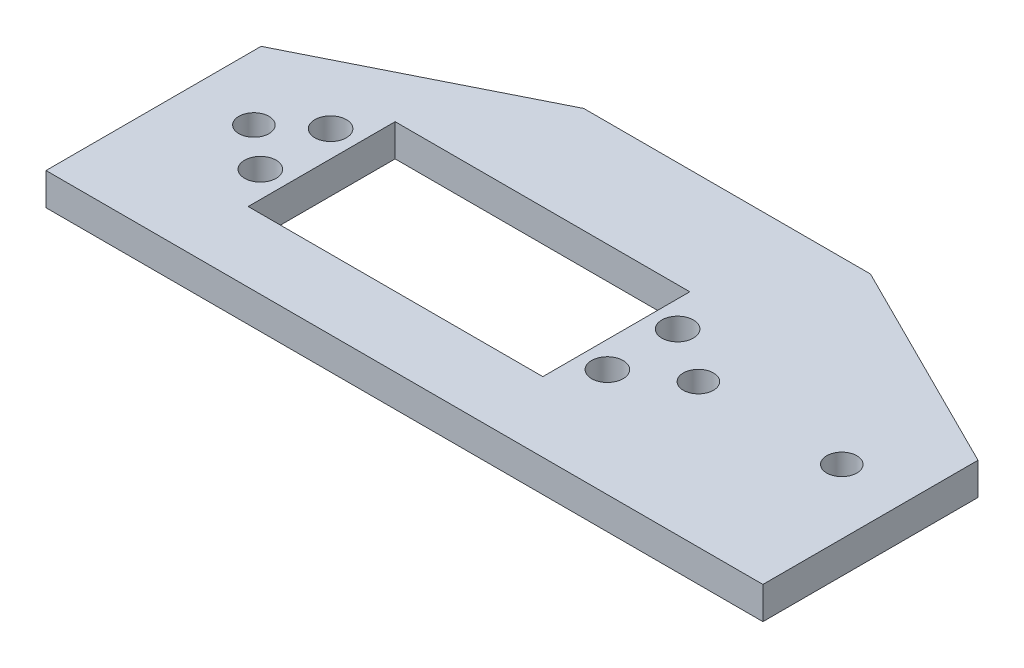
ISO-10303-21;
HEADER;
FILE_DESCRIPTION(('STEP AP214'),'2;1');
FILE_NAME('part.step','',(''),(''),'','','');
FILE_SCHEMA(('AUTOMOTIVE_DESIGN { 1 0 10303 214 1 1 1 1 }'));
ENDSEC;
DATA;
#1=APPLICATION_CONTEXT('core data for automotive mechanical design processes');
#2=APPLICATION_PROTOCOL_DEFINITION('international standard','automotive_design',2000,#1);
#3=PRODUCT_CONTEXT('',#1,'mechanical');
#4=PRODUCT('Part','Part','',(#3));
#5=PRODUCT_RELATED_PRODUCT_CATEGORY('part','',(#4));
#6=PRODUCT_DEFINITION_FORMATION('','',#4);
#7=PRODUCT_DEFINITION_CONTEXT('part definition',#1,'design');
#8=PRODUCT_DEFINITION('design','',#6,#7);
#9=PRODUCT_DEFINITION_SHAPE('','',#8);
#10=(LENGTH_UNIT() NAMED_UNIT(*) SI_UNIT(.MILLI.,.METRE.));
#11=(NAMED_UNIT(*) PLANE_ANGLE_UNIT() SI_UNIT($,.RADIAN.));
#12=(NAMED_UNIT(*) SI_UNIT($,.STERADIAN.) SOLID_ANGLE_UNIT());
#13=UNCERTAINTY_MEASURE_WITH_UNIT(LENGTH_MEASURE(1.E-05),#10,'distance_accuracy_value','');
#14=(GEOMETRIC_REPRESENTATION_CONTEXT(3) GLOBAL_UNCERTAINTY_ASSIGNED_CONTEXT((#13)) GLOBAL_UNIT_ASSIGNED_CONTEXT((#10,
#11,#12)) REPRESENTATION_CONTEXT('',''));
#15=CARTESIAN_POINT('',(0.,0.,0.));
#16=DIRECTION('',(0.,0.,1.));
#17=DIRECTION('',(1.,0.,0.));
#18=AXIS2_PLACEMENT_3D('',#15,#16,#17);
#19=CARTESIAN_POINT('',(0.,4.5,0.));
#20=DIRECTION('',(0.,1.,0.));
#21=DIRECTION('',(0.,0.,1.));
#22=AXIS2_PLACEMENT_3D('',#19,#20,#21);
#23=PLANE('',#22);
#24=DIRECTION('',(-1.,0.,0.));
#25=VECTOR('',#24,1.);
#26=CARTESIAN_POINT('',(0.,4.5,5.00000000000001));
#27=LINE('',#26,#25);
#28=CARTESIAN_POINT('',(50.,4.5,5.00000000000002));
#29=VERTEX_POINT('',#28);
#30=CARTESIAN_POINT('',(-50.,4.5,5.));
#31=VERTEX_POINT('',#30);
#32=EDGE_CURVE('E47',#29,#31,#27,.T.);
#33=ORIENTED_EDGE('',*,*,#32,.F.);
#34=DIRECTION('',(0.,0.,-1.));
#35=VECTOR('',#34,1.);
#36=CARTESIAN_POINT('',(50.,4.5,-25.));
#37=LINE('',#36,#35);
#38=CARTESIAN_POINT('',(50.,4.5,-25.));
#39=VERTEX_POINT('',#38);
#40=EDGE_CURVE('E131',#29,#39,#37,.T.);
#41=ORIENTED_EDGE('',*,*,#40,.T.);
#42=DIRECTION('',(-0.894427190999916,0.,-0.447213595499958));
#43=VECTOR('',#42,1.);
#44=CARTESIAN_POINT('',(20.,4.5,-40.));
#45=LINE('',#44,#43);
#46=CARTESIAN_POINT('',(20.,4.5,-40.));
#47=VERTEX_POINT('',#46);
#48=EDGE_CURVE('E134',#39,#47,#45,.T.);
#49=ORIENTED_EDGE('',*,*,#48,.T.);
#50=DIRECTION('',(-1.,0.,0.));
#51=VECTOR('',#50,1.);
#52=CARTESIAN_POINT('',(-20.,4.5,-40.));
#53=LINE('',#52,#51);
#54=CARTESIAN_POINT('',(-20.,4.5,-40.));
#55=VERTEX_POINT('',#54);
#56=EDGE_CURVE('E151',#47,#55,#53,.T.);
#57=ORIENTED_EDGE('',*,*,#56,.T.);
#58=DIRECTION('',(-0.894427190999916,0.,0.447213595499958));
#59=VECTOR('',#58,1.);
#60=CARTESIAN_POINT('',(-20.,4.5,-40.));
#61=LINE('',#60,#59);
#62=CARTESIAN_POINT('',(-50.,4.5,-25.));
#63=VERTEX_POINT('',#62);
#64=EDGE_CURVE('E160',#55,#63,#61,.T.);
#65=ORIENTED_EDGE('',*,*,#64,.T.);
#66=DIRECTION('',(0.,0.,1.));
#67=VECTOR('',#66,1.);
#68=CARTESIAN_POINT('',(-50.,4.5,-25.));
#69=LINE('',#68,#67);
#70=EDGE_CURVE('E142',#63,#31,#69,.T.);
#71=ORIENTED_EDGE('',*,*,#70,.T.);
#72=EDGE_LOOP('',(#33,#41,#49,#57,#65,#71));
#73=FACE_BOUND('',#72,.T.);
#74=CARTESIAN_POINT('',(-35.2,4.5,-10.1));
#75=DIRECTION('',(0.,1.,0.));
#76=DIRECTION('',(0.,0.,1.));
#77=AXIS2_PLACEMENT_3D('',#74,#75,#76);
#78=CIRCLE('',#77,2.20000000000001);
#79=CARTESIAN_POINT('',(-35.2,4.5,-7.89999999999999));
#80=VERTEX_POINT('',#79);
#81=EDGE_CURVE('E225',#80,#80,#78,.T.);
#82=ORIENTED_EDGE('',*,*,#81,.F.);
#83=EDGE_LOOP('',(#82));
#84=FACE_BOUND('',#83,.T.);
#85=CARTESIAN_POINT('',(-35.2,4.5,-19.9));
#86=DIRECTION('',(0.,1.,0.));
#87=DIRECTION('',(0.,0.,1.));
#88=AXIS2_PLACEMENT_3D('',#85,#86,#87);
#89=CIRCLE('',#88,2.20000000000001);
#90=CARTESIAN_POINT('',(-35.2,4.5,-17.7));
#91=VERTEX_POINT('',#90);
#92=EDGE_CURVE('E219',#91,#91,#89,.T.);
#93=ORIENTED_EDGE('',*,*,#92,.F.);
#94=EDGE_LOOP('',(#93));
#95=FACE_BOUND('',#94,.T.);
#96=CARTESIAN_POINT('',(13.2,4.5,-10.1));
#97=DIRECTION('',(0.,1.,0.));
#98=DIRECTION('',(0.,0.,1.));
#99=AXIS2_PLACEMENT_3D('',#96,#97,#98);
#100=CIRCLE('',#99,2.2);
#101=CARTESIAN_POINT('',(13.2,4.5,-7.89999999999999));
#102=VERTEX_POINT('',#101);
#103=EDGE_CURVE('E213',#102,#102,#100,.T.);
#104=ORIENTED_EDGE('',*,*,#103,.F.);
#105=EDGE_LOOP('',(#104));
#106=FACE_BOUND('',#105,.T.);
#107=CARTESIAN_POINT('',(13.2,4.5,-19.9));
#108=DIRECTION('',(0.,1.,0.));
#109=DIRECTION('',(0.,0.,1.));
#110=AXIS2_PLACEMENT_3D('',#107,#108,#109);
#111=CIRCLE('',#110,2.2);
#112=CARTESIAN_POINT('',(13.2,4.5,-17.7));
#113=VERTEX_POINT('',#112);
#114=EDGE_CURVE('E207',#113,#113,#111,.T.);
#115=ORIENTED_EDGE('',*,*,#114,.F.);
#116=EDGE_LOOP('',(#115));
#117=FACE_BOUND('',#116,.T.);
#118=DIRECTION('',(0.,0.,1.));
#119=VECTOR('',#118,1.);
#120=CARTESIAN_POINT('',(-31.55,4.5,0.));
#121=LINE('',#120,#119);
#122=CARTESIAN_POINT('',(-31.55,4.5,-25.25));
#123=VERTEX_POINT('',#122);
#124=CARTESIAN_POINT('',(-31.55,4.5,-4.75000000000001));
#125=VERTEX_POINT('',#124);
#126=EDGE_CURVE('E179',#123,#125,#121,.T.);
#127=ORIENTED_EDGE('',*,*,#126,.F.);
#128=DIRECTION('',(-1.,0.,0.));
#129=VECTOR('',#128,1.);
#130=CARTESIAN_POINT('',(0.,4.5,-25.25));
#131=LINE('',#130,#129);
#132=CARTESIAN_POINT('',(9.55000000000006,4.5,-25.25));
#133=VERTEX_POINT('',#132);
#134=EDGE_CURVE('E187',#133,#123,#131,.T.);
#135=ORIENTED_EDGE('',*,*,#134,.F.);
#136=DIRECTION('',(0.,0.,-1.));
#137=VECTOR('',#136,1.);
#138=CARTESIAN_POINT('',(9.55000000000005,4.5,0.));
#139=LINE('',#138,#137);
#140=CARTESIAN_POINT('',(9.55000000000005,4.5,-4.75000000000001));
#141=VERTEX_POINT('',#140);
#142=EDGE_CURVE('E185',#141,#133,#139,.T.);
#143=ORIENTED_EDGE('',*,*,#142,.F.);
#144=DIRECTION('',(1.,0.,0.));
#145=VECTOR('',#144,1.);
#146=CARTESIAN_POINT('',(0.,4.5,-4.75000000000001));
#147=LINE('',#146,#145);
#148=EDGE_CURVE('E183',#125,#141,#147,.T.);
#149=ORIENTED_EDGE('',*,*,#148,.F.);
#150=EDGE_LOOP('',(#127,#135,#143,#149));
#151=FACE_BOUND('',#150,.T.);
#152=CARTESIAN_POINT('',(-41.,4.5,-15.));
#153=DIRECTION('',(0.,1.,0.));
#154=DIRECTION('',(0.,0.,1.));
#155=AXIS2_PLACEMENT_3D('',#152,#153,#154);
#156=CIRCLE('',#155,2.1);
#157=CARTESIAN_POINT('',(-41.,4.5,-12.9));
#158=VERTEX_POINT('',#157);
#159=EDGE_CURVE('E158',#158,#158,#156,.T.);
#160=ORIENTED_EDGE('',*,*,#159,.F.);
#161=EDGE_LOOP('',(#160));
#162=FACE_BOUND('',#161,.T.);
#163=CARTESIAN_POINT('',(41.,4.5,-15.));
#164=DIRECTION('',(0.,1.,0.));
#165=DIRECTION('',(0.,0.,1.));
#166=AXIS2_PLACEMENT_3D('',#163,#164,#165);
#167=CIRCLE('',#166,2.1);
#168=CARTESIAN_POINT('',(41.,4.5,-12.9));
#169=VERTEX_POINT('',#168);
#170=EDGE_CURVE('E167',#169,#169,#167,.T.);
#171=ORIENTED_EDGE('',*,*,#170,.F.);
#172=EDGE_LOOP('',(#171));
#173=FACE_BOUND('',#172,.T.);
#174=CARTESIAN_POINT('',(21.,4.5,-15.));
#175=DIRECTION('',(0.,1.,0.));
#176=DIRECTION('',(0.,0.,1.));
#177=AXIS2_PLACEMENT_3D('',#174,#175,#176);
#178=CIRCLE('',#177,2.1);
#179=CARTESIAN_POINT('',(21.,4.5,-12.9));
#180=VERTEX_POINT('',#179);
#181=EDGE_CURVE('E173',#180,#180,#178,.T.);
#182=ORIENTED_EDGE('',*,*,#181,.F.);
#183=EDGE_LOOP('',(#182));
#184=FACE_BOUND('',#183,.T.);
#185=ADVANCED_FACE('F32',(#73,#84,#95,#106,#117,#151,#162,#173,#184),#23,.T.);
#186=CARTESIAN_POINT('',(0.,0.,0.));
#187=DIRECTION('',(0.,1.,0.));
#188=DIRECTION('',(0.,0.,1.));
#189=AXIS2_PLACEMENT_3D('',#186,#187,#188);
#190=PLANE('',#189);
#191=CARTESIAN_POINT('',(-35.2,0.,-10.1));
#192=DIRECTION('',(0.,-1.,0.));
#193=DIRECTION('',(0.,0.,-1.));
#194=AXIS2_PLACEMENT_3D('',#191,#192,#193);
#195=CIRCLE('',#194,2.20000000000001);
#196=CARTESIAN_POINT('',(-35.2,0.,-12.3));
#197=VERTEX_POINT('',#196);
#198=EDGE_CURVE('E228',#197,#197,#195,.T.);
#199=ORIENTED_EDGE('',*,*,#198,.F.);
#200=EDGE_LOOP('',(#199));
#201=FACE_BOUND('',#200,.T.);
#202=CARTESIAN_POINT('',(-35.2,0.,-19.9));
#203=DIRECTION('',(0.,-1.,0.));
#204=DIRECTION('',(0.,0.,-1.));
#205=AXIS2_PLACEMENT_3D('',#202,#203,#204);
#206=CIRCLE('',#205,2.20000000000001);
#207=CARTESIAN_POINT('',(-35.2,0.,-22.1));
#208=VERTEX_POINT('',#207);
#209=EDGE_CURVE('E222',#208,#208,#206,.T.);
#210=ORIENTED_EDGE('',*,*,#209,.F.);
#211=EDGE_LOOP('',(#210));
#212=FACE_BOUND('',#211,.T.);
#213=CARTESIAN_POINT('',(13.2,0.,-10.1));
#214=DIRECTION('',(0.,-1.,0.));
#215=DIRECTION('',(0.,0.,-1.));
#216=AXIS2_PLACEMENT_3D('',#213,#214,#215);
#217=CIRCLE('',#216,2.2);
#218=CARTESIAN_POINT('',(13.2,0.,-12.3));
#219=VERTEX_POINT('',#218);
#220=EDGE_CURVE('E216',#219,#219,#217,.T.);
#221=ORIENTED_EDGE('',*,*,#220,.F.);
#222=EDGE_LOOP('',(#221));
#223=FACE_BOUND('',#222,.T.);
#224=CARTESIAN_POINT('',(13.2,0.,-19.9));
#225=DIRECTION('',(0.,-1.,0.));
#226=DIRECTION('',(0.,0.,-1.));
#227=AXIS2_PLACEMENT_3D('',#224,#225,#226);
#228=CIRCLE('',#227,2.2);
#229=CARTESIAN_POINT('',(13.2,0.,-22.1));
#230=VERTEX_POINT('',#229);
#231=EDGE_CURVE('E210',#230,#230,#228,.T.);
#232=ORIENTED_EDGE('',*,*,#231,.F.);
#233=EDGE_LOOP('',(#232));
#234=FACE_BOUND('',#233,.T.);
#235=DIRECTION('',(1.,0.,0.));
#236=VECTOR('',#235,1.);
#237=CARTESIAN_POINT('',(9.55000000000006,0.,-25.25));
#238=LINE('',#237,#236);
#239=CARTESIAN_POINT('',(-31.55,0.,-25.25));
#240=VERTEX_POINT('',#239);
#241=CARTESIAN_POINT('',(9.55000000000006,0.,-25.25));
#242=VERTEX_POINT('',#241);
#243=EDGE_CURVE('E203',#240,#242,#238,.T.);
#244=ORIENTED_EDGE('',*,*,#243,.F.);
#245=DIRECTION('',(0.,0.,-1.));
#246=VECTOR('',#245,1.);
#247=CARTESIAN_POINT('',(-31.55,0.,-25.25));
#248=LINE('',#247,#246);
#249=CARTESIAN_POINT('',(-31.55,0.,-4.75000000000001));
#250=VERTEX_POINT('',#249);
#251=EDGE_CURVE('E205',#250,#240,#248,.T.);
#252=ORIENTED_EDGE('',*,*,#251,.F.);
#253=DIRECTION('',(-1.,0.,0.));
#254=VECTOR('',#253,1.);
#255=CARTESIAN_POINT('',(-31.55,0.,-4.75000000000001));
#256=LINE('',#255,#254);
#257=CARTESIAN_POINT('',(9.55000000000005,0.,-4.75000000000001));
#258=VERTEX_POINT('',#257);
#259=EDGE_CURVE('E193',#258,#250,#256,.T.);
#260=ORIENTED_EDGE('',*,*,#259,.F.);
#261=DIRECTION('',(0.,0.,1.));
#262=VECTOR('',#261,1.);
#263=CARTESIAN_POINT('',(9.55000000000005,0.,-4.75000000000001));
#264=LINE('',#263,#262);
#265=EDGE_CURVE('E200',#242,#258,#264,.T.);
#266=ORIENTED_EDGE('',*,*,#265,.F.);
#267=EDGE_LOOP('',(#244,#252,#260,#266));
#268=FACE_BOUND('',#267,.T.);
#269=CARTESIAN_POINT('',(-41.,0.,-15.));
#270=DIRECTION('',(0.,1.,0.));
#271=DIRECTION('',(0.,0.,1.));
#272=AXIS2_PLACEMENT_3D('',#269,#270,#271);
#273=CIRCLE('',#272,2.1);
#274=CARTESIAN_POINT('',(-41.,0.,-12.9));
#275=VERTEX_POINT('',#274);
#276=EDGE_CURVE('E164',#275,#275,#273,.T.);
#277=ORIENTED_EDGE('',*,*,#276,.T.);
#278=EDGE_LOOP('',(#277));
#279=FACE_BOUND('',#278,.T.);
#280=DIRECTION('',(0.,0.,-1.));
#281=VECTOR('',#280,1.);
#282=CARTESIAN_POINT('',(50.,0.,-25.));
#283=LINE('',#282,#281);
#284=CARTESIAN_POINT('',(50.,0.,5.00000000000002));
#285=VERTEX_POINT('',#284);
#286=CARTESIAN_POINT('',(50.,0.,-25.));
#287=VERTEX_POINT('',#286);
#288=EDGE_CURVE('E125',#285,#287,#283,.T.);
#289=ORIENTED_EDGE('',*,*,#288,.F.);
#290=DIRECTION('',(1.,0.,0.));
#291=VECTOR('',#290,1.);
#292=CARTESIAN_POINT('',(50.,0.,5.00000000000002));
#293=LINE('',#292,#291);
#294=CARTESIAN_POINT('',(-50.,0.,5.));
#295=VERTEX_POINT('',#294);
#296=EDGE_CURVE('E109',#295,#285,#293,.T.);
#297=ORIENTED_EDGE('',*,*,#296,.F.);
#298=DIRECTION('',(0.,0.,1.));
#299=VECTOR('',#298,1.);
#300=CARTESIAN_POINT('',(-50.,0.,-25.));
#301=LINE('',#300,#299);
#302=CARTESIAN_POINT('',(-50.,0.,-25.));
#303=VERTEX_POINT('',#302);
#304=EDGE_CURVE('E123',#303,#295,#301,.T.);
#305=ORIENTED_EDGE('',*,*,#304,.F.);
#306=DIRECTION('',(-0.894427190999916,0.,0.447213595499958));
#307=VECTOR('',#306,1.);
#308=CARTESIAN_POINT('',(-20.,0.,-40.));
#309=LINE('',#308,#307);
#310=CARTESIAN_POINT('',(-20.,0.,-40.));
#311=VERTEX_POINT('',#310);
#312=EDGE_CURVE('E132',#311,#303,#309,.T.);
#313=ORIENTED_EDGE('',*,*,#312,.F.);
#314=DIRECTION('',(-1.,0.,0.));
#315=VECTOR('',#314,1.);
#316=CARTESIAN_POINT('',(-20.,0.,-40.));
#317=LINE('',#316,#315);
#318=CARTESIAN_POINT('',(20.,0.,-40.));
#319=VERTEX_POINT('',#318);
#320=EDGE_CURVE('E136',#319,#311,#317,.T.);
#321=ORIENTED_EDGE('',*,*,#320,.F.);
#322=DIRECTION('',(-0.894427190999916,0.,-0.447213595499958));
#323=VECTOR('',#322,1.);
#324=CARTESIAN_POINT('',(20.,0.,-40.));
#325=LINE('',#324,#323);
#326=EDGE_CURVE('E154',#287,#319,#325,.T.);
#327=ORIENTED_EDGE('',*,*,#326,.F.);
#328=EDGE_LOOP('',(#289,#297,#305,#313,#321,#327));
#329=FACE_BOUND('',#328,.T.);
#330=CARTESIAN_POINT('',(41.,0.,-15.));
#331=DIRECTION('',(0.,1.,0.));
#332=DIRECTION('',(0.,0.,1.));
#333=AXIS2_PLACEMENT_3D('',#330,#331,#332);
#334=CIRCLE('',#333,2.1);
#335=CARTESIAN_POINT('',(41.,0.,-12.9));
#336=VERTEX_POINT('',#335);
#337=EDGE_CURVE('E170',#336,#336,#334,.T.);
#338=ORIENTED_EDGE('',*,*,#337,.T.);
#339=EDGE_LOOP('',(#338));
#340=FACE_BOUND('',#339,.T.);
#341=CARTESIAN_POINT('',(21.,0.,-15.));
#342=DIRECTION('',(0.,1.,0.));
#343=DIRECTION('',(0.,0.,1.));
#344=AXIS2_PLACEMENT_3D('',#341,#342,#343);
#345=CIRCLE('',#344,2.1);
#346=CARTESIAN_POINT('',(21.,0.,-12.9));
#347=VERTEX_POINT('',#346);
#348=EDGE_CURVE('E176',#347,#347,#345,.T.);
#349=ORIENTED_EDGE('',*,*,#348,.T.);
#350=EDGE_LOOP('',(#349));
#351=FACE_BOUND('',#350,.T.);
#352=ADVANCED_FACE('F120',(#201,#212,#223,#234,#268,#279,#329,#340,#351),#190,.F.);
#353=CARTESIAN_POINT('',(50.,4.5,-25.));
#354=DIRECTION('',(-1.,0.,0.));
#355=DIRECTION('',(0.,0.,1.));
#356=AXIS2_PLACEMENT_3D('',#353,#354,#355);
#357=PLANE('',#356);
#358=ORIENTED_EDGE('',*,*,#40,.F.);
#359=DIRECTION('',(0.,-1.,0.));
#360=VECTOR('',#359,1.);
#361=CARTESIAN_POINT('',(50.,10.,5.00000000000002));
#362=LINE('',#361,#360);
#363=EDGE_CURVE('E115',#29,#285,#362,.T.);
#364=ORIENTED_EDGE('',*,*,#363,.T.);
#365=ORIENTED_EDGE('',*,*,#288,.T.);
#366=DIRECTION('',(0.,-1.,0.));
#367=VECTOR('',#366,1.);
#368=CARTESIAN_POINT('',(50.,4.5,-25.));
#369=LINE('',#368,#367);
#370=EDGE_CURVE('E11',#39,#287,#369,.T.);
#371=ORIENTED_EDGE('',*,*,#370,.F.);
#372=EDGE_LOOP('',(#358,#364,#365,#371));
#373=FACE_BOUND('',#372,.T.);
#374=ADVANCED_FACE('F34',(#373),#357,.F.);
#375=CARTESIAN_POINT('',(20.,4.5,-40.));
#376=DIRECTION('',(-0.447213595499958,0.,0.894427190999916));
#377=DIRECTION('',(0.894427190999916,0.,0.447213595499958));
#378=AXIS2_PLACEMENT_3D('',#375,#376,#377);
#379=PLANE('',#378);
#380=ORIENTED_EDGE('',*,*,#326,.T.);
#381=DIRECTION('',(0.,-1.,0.));
#382=VECTOR('',#381,1.);
#383=CARTESIAN_POINT('',(20.,4.5,-40.));
#384=LINE('',#383,#382);
#385=EDGE_CURVE('E40',#47,#319,#384,.T.);
#386=ORIENTED_EDGE('',*,*,#385,.F.);
#387=ORIENTED_EDGE('',*,*,#48,.F.);
#388=ORIENTED_EDGE('',*,*,#370,.T.);
#389=EDGE_LOOP('',(#380,#386,#387,#388));
#390=FACE_BOUND('',#389,.T.);
#391=ADVANCED_FACE('F248',(#390),#379,.F.);
#392=CARTESIAN_POINT('',(-20.,4.5,-40.));
#393=DIRECTION('',(0.,0.,1.));
#394=DIRECTION('',(1.,0.,0.));
#395=AXIS2_PLACEMENT_3D('',#392,#393,#394);
#396=PLANE('',#395);
#397=ORIENTED_EDGE('',*,*,#320,.T.);
#398=DIRECTION('',(0.,-1.,0.));
#399=VECTOR('',#398,1.);
#400=CARTESIAN_POINT('',(-20.,4.5,-40.));
#401=LINE('',#400,#399);
#402=EDGE_CURVE('E141',#55,#311,#401,.T.);
#403=ORIENTED_EDGE('',*,*,#402,.F.);
#404=ORIENTED_EDGE('',*,*,#56,.F.);
#405=ORIENTED_EDGE('',*,*,#385,.T.);
#406=EDGE_LOOP('',(#397,#403,#404,#405));
#407=FACE_BOUND('',#406,.T.);
#408=ADVANCED_FACE('F149',(#407),#396,.F.);
#409=CARTESIAN_POINT('',(-20.,4.5,-40.));
#410=DIRECTION('',(0.447213595499958,0.,0.894427190999916));
#411=DIRECTION('',(0.894427190999916,0.,-0.447213595499958));
#412=AXIS2_PLACEMENT_3D('',#409,#410,#411);
#413=PLANE('',#412);
#414=ORIENTED_EDGE('',*,*,#312,.T.);
#415=DIRECTION('',(0.,-1.,0.));
#416=VECTOR('',#415,1.);
#417=CARTESIAN_POINT('',(-50.,4.5,-25.));
#418=LINE('',#417,#416);
#419=EDGE_CURVE('E130',#63,#303,#418,.T.);
#420=ORIENTED_EDGE('',*,*,#419,.F.);
#421=ORIENTED_EDGE('',*,*,#64,.F.);
#422=ORIENTED_EDGE('',*,*,#402,.T.);
#423=EDGE_LOOP('',(#414,#420,#421,#422));
#424=FACE_BOUND('',#423,.T.);
#425=ADVANCED_FACE('F239',(#424),#413,.F.);
#426=CARTESIAN_POINT('',(-50.,4.5,-25.));
#427=DIRECTION('',(1.,0.,0.));
#428=DIRECTION('',(0.,0.,-1.));
#429=AXIS2_PLACEMENT_3D('',#426,#427,#428);
#430=PLANE('',#429);
#431=ORIENTED_EDGE('',*,*,#304,.T.);
#432=DIRECTION('',(0.,-1.,0.));
#433=VECTOR('',#432,1.);
#434=CARTESIAN_POINT('',(-50.,10.,5.));
#435=LINE('',#434,#433);
#436=EDGE_CURVE('E106',#31,#295,#435,.T.);
#437=ORIENTED_EDGE('',*,*,#436,.F.);
#438=ORIENTED_EDGE('',*,*,#70,.F.);
#439=ORIENTED_EDGE('',*,*,#419,.T.);
#440=EDGE_LOOP('',(#431,#437,#438,#439));
#441=FACE_BOUND('',#440,.T.);
#442=ADVANCED_FACE('F128',(#441),#430,.F.);
#443=CARTESIAN_POINT('',(-41.,4.5,-15.));
#444=DIRECTION('',(0.,-1.,0.));
#445=DIRECTION('',(0.,0.,-1.));
#446=AXIS2_PLACEMENT_3D('',#443,#444,#445);
#447=CYLINDRICAL_SURFACE('',#446,2.1);
#448=ORIENTED_EDGE('',*,*,#159,.T.);
#449=EDGE_LOOP('',(#448));
#450=FACE_BOUND('',#449,.T.);
#451=ORIENTED_EDGE('',*,*,#276,.F.);
#452=EDGE_LOOP('',(#451));
#453=FACE_BOUND('',#452,.T.);
#454=ADVANCED_FACE('F246',(#450,#453),#447,.F.);
#455=CARTESIAN_POINT('',(41.,4.5,-15.));
#456=DIRECTION('',(0.,-1.,0.));
#457=DIRECTION('',(0.,0.,-1.));
#458=AXIS2_PLACEMENT_3D('',#455,#456,#457);
#459=CYLINDRICAL_SURFACE('',#458,2.1);
#460=ORIENTED_EDGE('',*,*,#170,.T.);
#461=EDGE_LOOP('',(#460));
#462=FACE_BOUND('',#461,.T.);
#463=ORIENTED_EDGE('',*,*,#337,.F.);
#464=EDGE_LOOP('',(#463));
#465=FACE_BOUND('',#464,.T.);
#466=ADVANCED_FACE('F260',(#462,#465),#459,.F.);
#467=CARTESIAN_POINT('',(21.,4.5,-15.));
#468=DIRECTION('',(0.,-1.,0.));
#469=DIRECTION('',(0.,0.,-1.));
#470=AXIS2_PLACEMENT_3D('',#467,#468,#469);
#471=CYLINDRICAL_SURFACE('',#470,2.1);
#472=ORIENTED_EDGE('',*,*,#181,.T.);
#473=EDGE_LOOP('',(#472));
#474=FACE_BOUND('',#473,.T.);
#475=ORIENTED_EDGE('',*,*,#348,.F.);
#476=EDGE_LOOP('',(#475));
#477=FACE_BOUND('',#476,.T.);
#478=ADVANCED_FACE('F264',(#474,#477),#471,.F.);
#479=CARTESIAN_POINT('',(-31.55,10.,-25.25));
#480=DIRECTION('',(-1.,0.,0.));
#481=DIRECTION('',(0.,0.,1.));
#482=AXIS2_PLACEMENT_3D('',#479,#480,#481);
#483=PLANE('',#482);
#484=ORIENTED_EDGE('',*,*,#126,.T.);
#485=DIRECTION('',(0.,-1.,0.));
#486=VECTOR('',#485,1.);
#487=CARTESIAN_POINT('',(-31.55,10.,-4.75000000000001));
#488=LINE('',#487,#486);
#489=EDGE_CURVE('E189',#125,#250,#488,.T.);
#490=ORIENTED_EDGE('',*,*,#489,.T.);
#491=ORIENTED_EDGE('',*,*,#251,.T.);
#492=DIRECTION('',(0.,-1.,0.));
#493=VECTOR('',#492,1.);
#494=CARTESIAN_POINT('',(-31.55,10.,-25.25));
#495=LINE('',#494,#493);
#496=EDGE_CURVE('E190',#123,#240,#495,.T.);
#497=ORIENTED_EDGE('',*,*,#496,.F.);
#498=EDGE_LOOP('',(#484,#490,#491,#497));
#499=FACE_BOUND('',#498,.T.);
#500=ADVANCED_FACE('F268',(#499),#483,.F.);
#501=CARTESIAN_POINT('',(-31.55,10.,-4.75000000000001));
#502=DIRECTION('',(0.,0.,1.));
#503=DIRECTION('',(1.,0.,0.));
#504=AXIS2_PLACEMENT_3D('',#501,#502,#503);
#505=PLANE('',#504);
#506=ORIENTED_EDGE('',*,*,#148,.T.);
#507=DIRECTION('',(0.,-1.,0.));
#508=VECTOR('',#507,1.);
#509=CARTESIAN_POINT('',(9.55000000000005,10.,-4.75000000000001));
#510=LINE('',#509,#508);
#511=EDGE_CURVE('E195',#141,#258,#510,.T.);
#512=ORIENTED_EDGE('',*,*,#511,.T.);
#513=ORIENTED_EDGE('',*,*,#259,.T.);
#514=ORIENTED_EDGE('',*,*,#489,.F.);
#515=EDGE_LOOP('',(#506,#512,#513,#514));
#516=FACE_BOUND('',#515,.T.);
#517=ADVANCED_FACE('F272',(#516),#505,.F.);
#518=CARTESIAN_POINT('',(9.55000000000005,10.,-4.75000000000001));
#519=DIRECTION('',(1.,0.,0.));
#520=DIRECTION('',(0.,0.,-1.));
#521=AXIS2_PLACEMENT_3D('',#518,#519,#520);
#522=PLANE('',#521);
#523=ORIENTED_EDGE('',*,*,#142,.T.);
#524=DIRECTION('',(0.,-1.,0.));
#525=VECTOR('',#524,1.);
#526=CARTESIAN_POINT('',(9.55000000000006,10.,-25.25));
#527=LINE('',#526,#525);
#528=EDGE_CURVE('E55',#133,#242,#527,.T.);
#529=ORIENTED_EDGE('',*,*,#528,.T.);
#530=ORIENTED_EDGE('',*,*,#265,.T.);
#531=ORIENTED_EDGE('',*,*,#511,.F.);
#532=EDGE_LOOP('',(#523,#529,#530,#531));
#533=FACE_BOUND('',#532,.T.);
#534=ADVANCED_FACE('F278',(#533),#522,.F.);
#535=CARTESIAN_POINT('',(9.55000000000006,10.,-25.25));
#536=DIRECTION('',(0.,0.,-1.));
#537=DIRECTION('',(-1.,0.,0.));
#538=AXIS2_PLACEMENT_3D('',#535,#536,#537);
#539=PLANE('',#538);
#540=ORIENTED_EDGE('',*,*,#134,.T.);
#541=ORIENTED_EDGE('',*,*,#496,.T.);
#542=ORIENTED_EDGE('',*,*,#243,.T.);
#543=ORIENTED_EDGE('',*,*,#528,.F.);
#544=EDGE_LOOP('',(#540,#541,#542,#543));
#545=FACE_BOUND('',#544,.T.);
#546=ADVANCED_FACE('F274',(#545),#539,.F.);
#547=CARTESIAN_POINT('',(13.2,10.,-19.9));
#548=DIRECTION('',(0.,-1.,0.));
#549=DIRECTION('',(0.,0.,-1.));
#550=AXIS2_PLACEMENT_3D('',#547,#548,#549);
#551=CYLINDRICAL_SURFACE('',#550,2.2);
#552=ORIENTED_EDGE('',*,*,#114,.T.);
#553=EDGE_LOOP('',(#552));
#554=FACE_BOUND('',#553,.T.);
#555=ORIENTED_EDGE('',*,*,#231,.T.);
#556=EDGE_LOOP('',(#555));
#557=FACE_BOUND('',#556,.T.);
#558=ADVANCED_FACE('F277',(#554,#557),#551,.F.);
#559=CARTESIAN_POINT('',(13.2,10.,-10.1));
#560=DIRECTION('',(0.,-1.,0.));
#561=DIRECTION('',(0.,0.,-1.));
#562=AXIS2_PLACEMENT_3D('',#559,#560,#561);
#563=CYLINDRICAL_SURFACE('',#562,2.2);
#564=ORIENTED_EDGE('',*,*,#103,.T.);
#565=EDGE_LOOP('',(#564));
#566=FACE_BOUND('',#565,.T.);
#567=ORIENTED_EDGE('',*,*,#220,.T.);
#568=EDGE_LOOP('',(#567));
#569=FACE_BOUND('',#568,.T.);
#570=ADVANCED_FACE('F287',(#566,#569),#563,.F.);
#571=CARTESIAN_POINT('',(-35.2,10.,-19.9));
#572=DIRECTION('',(0.,-1.,0.));
#573=DIRECTION('',(0.,0.,-1.));
#574=AXIS2_PLACEMENT_3D('',#571,#572,#573);
#575=CYLINDRICAL_SURFACE('',#574,2.20000000000001);
#576=ORIENTED_EDGE('',*,*,#92,.T.);
#577=EDGE_LOOP('',(#576));
#578=FACE_BOUND('',#577,.T.);
#579=ORIENTED_EDGE('',*,*,#209,.T.);
#580=EDGE_LOOP('',(#579));
#581=FACE_BOUND('',#580,.T.);
#582=ADVANCED_FACE('F291',(#578,#581),#575,.F.);
#583=CARTESIAN_POINT('',(-35.2,10.,-10.1));
#584=DIRECTION('',(0.,-1.,0.));
#585=DIRECTION('',(0.,0.,-1.));
#586=AXIS2_PLACEMENT_3D('',#583,#584,#585);
#587=CYLINDRICAL_SURFACE('',#586,2.20000000000001);
#588=ORIENTED_EDGE('',*,*,#81,.T.);
#589=EDGE_LOOP('',(#588));
#590=FACE_BOUND('',#589,.T.);
#591=ORIENTED_EDGE('',*,*,#198,.T.);
#592=EDGE_LOOP('',(#591));
#593=FACE_BOUND('',#592,.T.);
#594=ADVANCED_FACE('F295',(#590,#593),#587,.F.);
#595=CARTESIAN_POINT('',(50.,10.,5.00000000000002));
#596=DIRECTION('',(0.,0.,-1.));
#597=DIRECTION('',(-1.,0.,0.));
#598=AXIS2_PLACEMENT_3D('',#595,#596,#597);
#599=PLANE('',#598);
#600=ORIENTED_EDGE('',*,*,#32,.T.);
#601=ORIENTED_EDGE('',*,*,#436,.T.);
#602=ORIENTED_EDGE('',*,*,#296,.T.);
#603=ORIENTED_EDGE('',*,*,#363,.F.);
#604=EDGE_LOOP('',(#600,#601,#602,#603));
#605=FACE_BOUND('',#604,.T.);
#606=ADVANCED_FACE('F108',(#605),#599,.F.);
#607=CLOSED_SHELL('',(#185,#352,#374,#391,#408,#425,#442,#454,#466,#478,#500,#517,#534,#546,
#558,#570,#582,#594,#606));
#608=MANIFOLD_SOLID_BREP('B2',#607);
#609=ADVANCED_BREP_SHAPE_REPRESENTATION('',(#18,#608),#14);
#610=SHAPE_DEFINITION_REPRESENTATION(#9,#609);
ENDSEC;
END-ISO-10303-21;
